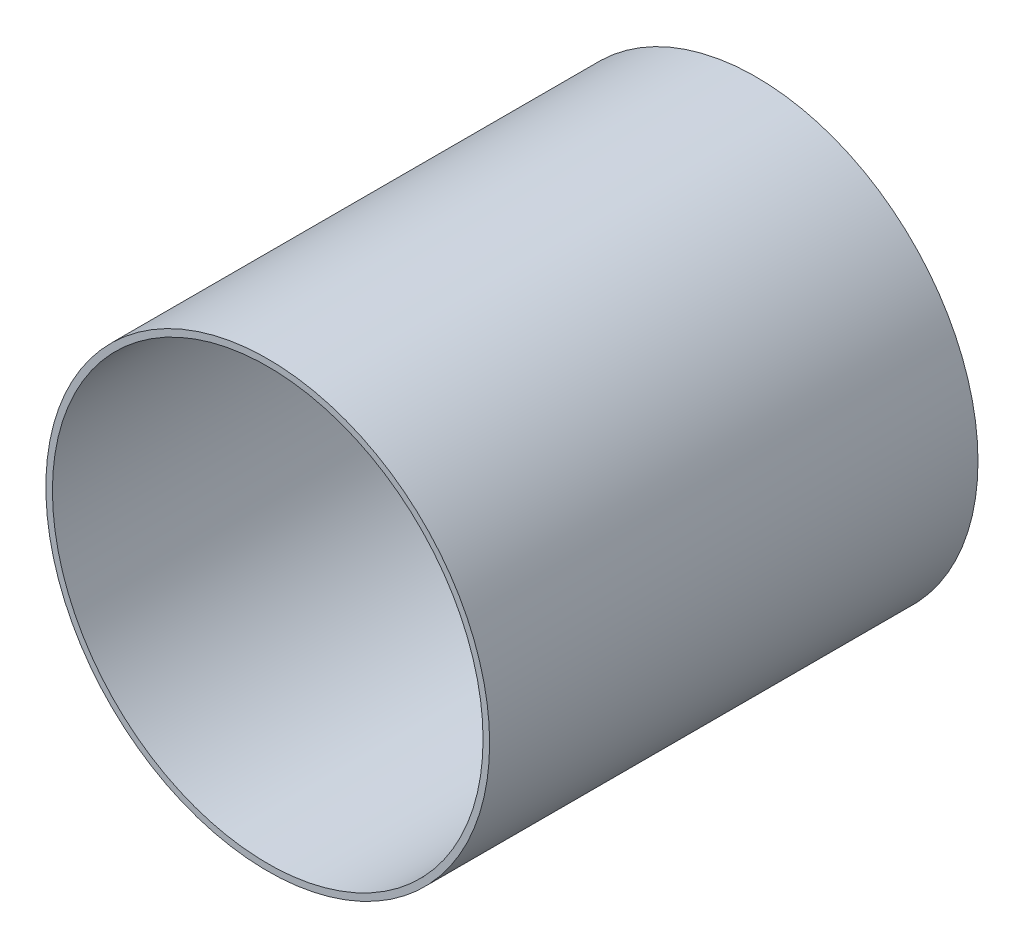
ISO-10303-21;
HEADER;
FILE_DESCRIPTION(('STEP AP214'),'2;1');
FILE_NAME('part.step','',(''),(''),'','','');
FILE_SCHEMA(('AUTOMOTIVE_DESIGN { 1 0 10303 214 1 1 1 1 }'));
ENDSEC;
DATA;
#1=APPLICATION_CONTEXT('core data for automotive mechanical design processes');
#2=APPLICATION_PROTOCOL_DEFINITION('international standard','automotive_design',2000,#1);
#3=PRODUCT_CONTEXT('',#1,'mechanical');
#4=PRODUCT('Part','Part','',(#3));
#5=PRODUCT_RELATED_PRODUCT_CATEGORY('part','',(#4));
#6=PRODUCT_DEFINITION_FORMATION('','',#4);
#7=PRODUCT_DEFINITION_CONTEXT('part definition',#1,'design');
#8=PRODUCT_DEFINITION('design','',#6,#7);
#9=PRODUCT_DEFINITION_SHAPE('','',#8);
#10=(LENGTH_UNIT() NAMED_UNIT(*) SI_UNIT(.MILLI.,.METRE.));
#11=(NAMED_UNIT(*) PLANE_ANGLE_UNIT() SI_UNIT($,.RADIAN.));
#12=(NAMED_UNIT(*) SI_UNIT($,.STERADIAN.) SOLID_ANGLE_UNIT());
#13=UNCERTAINTY_MEASURE_WITH_UNIT(LENGTH_MEASURE(1.E-05),#10,'distance_accuracy_value','');
#14=(GEOMETRIC_REPRESENTATION_CONTEXT(3) GLOBAL_UNCERTAINTY_ASSIGNED_CONTEXT((#13)) GLOBAL_UNIT_ASSIGNED_CONTEXT((#10,
#11,#12)) REPRESENTATION_CONTEXT('',''));
#15=CARTESIAN_POINT('',(0.,0.,0.));
#16=DIRECTION('',(0.,0.,1.));
#17=DIRECTION('',(1.,0.,0.));
#18=AXIS2_PLACEMENT_3D('',#15,#16,#17);
#19=CARTESIAN_POINT('',(0.,0.,69.85));
#20=DIRECTION('',(0.,0.,1.));
#21=DIRECTION('',(1.,0.,0.));
#22=AXIS2_PLACEMENT_3D('',#19,#20,#21);
#23=PLANE('',#22);
#24=CARTESIAN_POINT('',(0.,0.,69.85));
#25=DIRECTION('',(0.,0.,1.));
#26=DIRECTION('',(1.,0.,0.));
#27=AXIS2_PLACEMENT_3D('',#24,#25,#26);
#28=CIRCLE('',#27,63.4746);
#29=CARTESIAN_POINT('',(63.4746,0.,69.85));
#30=VERTEX_POINT('',#29);
#31=EDGE_CURVE('E10',#30,#30,#28,.T.);
#32=ORIENTED_EDGE('',*,*,#31,.T.);
#33=EDGE_LOOP('',(#32));
#34=FACE_BOUND('',#33,.T.);
#35=CARTESIAN_POINT('',(0.,0.,69.85));
#36=DIRECTION('',(0.,0.,1.));
#37=DIRECTION('',(1.,0.,0.));
#38=AXIS2_PLACEMENT_3D('',#35,#36,#37);
#39=CIRCLE('',#38,61.595);
#40=CARTESIAN_POINT('',(61.595,0.,69.85));
#41=VERTEX_POINT('',#40);
#42=EDGE_CURVE('E54',#41,#41,#39,.T.);
#43=ORIENTED_EDGE('',*,*,#42,.F.);
#44=EDGE_LOOP('',(#43));
#45=FACE_BOUND('',#44,.T.);
#46=ADVANCED_FACE('F43',(#34,#45),#23,.T.);
#47=CARTESIAN_POINT('',(0.,0.,-69.85));
#48=DIRECTION('',(0.,0.,1.));
#49=DIRECTION('',(1.,0.,0.));
#50=AXIS2_PLACEMENT_3D('',#47,#48,#49);
#51=PLANE('',#50);
#52=CARTESIAN_POINT('',(0.,0.,-69.85));
#53=DIRECTION('',(0.,0.,1.));
#54=DIRECTION('',(1.,0.,0.));
#55=AXIS2_PLACEMENT_3D('',#52,#53,#54);
#56=CIRCLE('',#55,63.4746);
#57=CARTESIAN_POINT('',(63.4746,0.,-69.85));
#58=VERTEX_POINT('',#57);
#59=EDGE_CURVE('E47',#58,#58,#56,.T.);
#60=ORIENTED_EDGE('',*,*,#59,.F.);
#61=EDGE_LOOP('',(#60));
#62=FACE_BOUND('',#61,.T.);
#63=CARTESIAN_POINT('',(0.,0.,-69.85));
#64=DIRECTION('',(0.,0.,1.));
#65=DIRECTION('',(1.,0.,0.));
#66=AXIS2_PLACEMENT_3D('',#63,#64,#65);
#67=CIRCLE('',#66,61.595);
#68=CARTESIAN_POINT('',(61.595,0.,-69.85));
#69=VERTEX_POINT('',#68);
#70=EDGE_CURVE('E56',#69,#69,#67,.T.);
#71=ORIENTED_EDGE('',*,*,#70,.T.);
#72=EDGE_LOOP('',(#71));
#73=FACE_BOUND('',#72,.T.);
#74=ADVANCED_FACE('F66',(#62,#73),#51,.F.);
#75=CARTESIAN_POINT('',(0.,0.,69.85));
#76=DIRECTION('',(0.,0.,-1.));
#77=DIRECTION('',(-1.,0.,0.));
#78=AXIS2_PLACEMENT_3D('',#75,#76,#77);
#79=CYLINDRICAL_SURFACE('',#78,63.4746);
#80=ORIENTED_EDGE('',*,*,#31,.F.);
#81=EDGE_LOOP('',(#80));
#82=FACE_BOUND('',#81,.T.);
#83=ORIENTED_EDGE('',*,*,#59,.T.);
#84=EDGE_LOOP('',(#83));
#85=FACE_BOUND('',#84,.T.);
#86=ADVANCED_FACE('F45',(#82,#85),#79,.T.);
#87=CARTESIAN_POINT('',(0.,0.,69.85));
#88=DIRECTION('',(0.,0.,-1.));
#89=DIRECTION('',(-1.,0.,0.));
#90=AXIS2_PLACEMENT_3D('',#87,#88,#89);
#91=CYLINDRICAL_SURFACE('',#90,61.595);
#92=ORIENTED_EDGE('',*,*,#42,.T.);
#93=EDGE_LOOP('',(#92));
#94=FACE_BOUND('',#93,.T.);
#95=ORIENTED_EDGE('',*,*,#70,.F.);
#96=EDGE_LOOP('',(#95));
#97=FACE_BOUND('',#96,.T.);
#98=ADVANCED_FACE('F62',(#94,#97),#91,.F.);
#99=CLOSED_SHELL('',(#46,#74,#86,#98));
#100=MANIFOLD_SOLID_BREP('B2',#99);
#101=ADVANCED_BREP_SHAPE_REPRESENTATION('',(#18,#100),#14);
#102=SHAPE_DEFINITION_REPRESENTATION(#9,#101);
ENDSEC;
END-ISO-10303-21;
